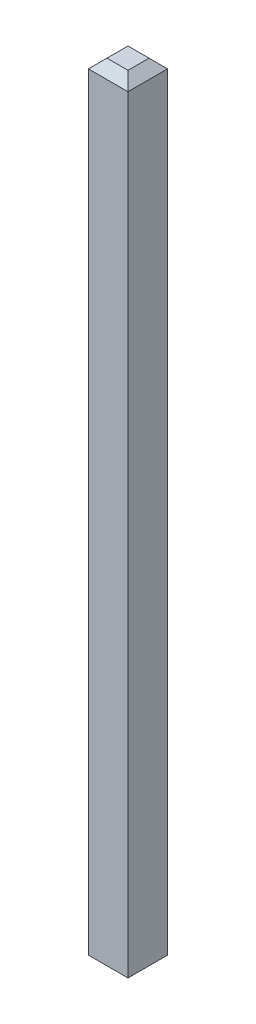
ISO-10303-21;
HEADER;
FILE_DESCRIPTION(('STEP AP214'),'2;1');
FILE_NAME('part.step','',(''),(''),'','','');
FILE_SCHEMA(('AUTOMOTIVE_DESIGN { 1 0 10303 214 1 1 1 1 }'));
ENDSEC;
DATA;
#1=APPLICATION_CONTEXT('core data for automotive mechanical design processes');
#2=APPLICATION_PROTOCOL_DEFINITION('international standard','automotive_design',2000,#1);
#3=PRODUCT_CONTEXT('',#1,'mechanical');
#4=PRODUCT('Part','Part','',(#3));
#5=PRODUCT_RELATED_PRODUCT_CATEGORY('part','',(#4));
#6=PRODUCT_DEFINITION_FORMATION('','',#4);
#7=PRODUCT_DEFINITION_CONTEXT('part definition',#1,'design');
#8=PRODUCT_DEFINITION('design','',#6,#7);
#9=PRODUCT_DEFINITION_SHAPE('','',#8);
#10=(LENGTH_UNIT() NAMED_UNIT(*) SI_UNIT(.MILLI.,.METRE.));
#11=(NAMED_UNIT(*) PLANE_ANGLE_UNIT() SI_UNIT($,.RADIAN.));
#12=(NAMED_UNIT(*) SI_UNIT($,.STERADIAN.) SOLID_ANGLE_UNIT());
#13=UNCERTAINTY_MEASURE_WITH_UNIT(LENGTH_MEASURE(1.E-05),#10,'distance_accuracy_value','');
#14=(GEOMETRIC_REPRESENTATION_CONTEXT(3) GLOBAL_UNCERTAINTY_ASSIGNED_CONTEXT((#13)) GLOBAL_UNIT_ASSIGNED_CONTEXT((#10,
#11,#12)) REPRESENTATION_CONTEXT('',''));
#15=CARTESIAN_POINT('',(0.,0.,0.));
#16=DIRECTION('',(0.,0.,1.));
#17=DIRECTION('',(1.,0.,0.));
#18=AXIS2_PLACEMENT_3D('',#15,#16,#17);
#19=CARTESIAN_POINT('',(-4.055,-1.925,-0.16));
#20=DIRECTION('',(-0.707106781186548,-0.707106781186548,0.));
#21=DIRECTION('',(0.707106781186548,-0.707106781186548,0.));
#22=AXIS2_PLACEMENT_3D('',#19,#20,#21);
#23=PLANE('',#22);
#24=DIRECTION('',(0.,0.,1.));
#25=VECTOR('',#24,1.);
#26=CARTESIAN_POINT('',(-4.13,-1.85,-0.32));
#27=LINE('',#26,#25);
#28=CARTESIAN_POINT('',(-4.13,-1.85,-0.32));
#29=VERTEX_POINT('',#28);
#30=CARTESIAN_POINT('',(-4.13,-1.85,0.32));
#31=VERTEX_POINT('',#30);
#32=EDGE_CURVE('E96',#29,#31,#27,.T.);
#33=ORIENTED_EDGE('',*,*,#32,.F.);
#34=DIRECTION('',(-0.577350269189626,0.577350269189626,-0.577350269189625));
#35=VECTOR('',#34,1.);
#36=CARTESIAN_POINT('',(-3.98,-2.,-0.17));
#37=LINE('',#36,#35);
#38=CARTESIAN_POINT('',(-3.98,-2.,-0.17));
#39=VERTEX_POINT('',#38);
#40=EDGE_CURVE('E94',#39,#29,#37,.T.);
#41=ORIENTED_EDGE('',*,*,#40,.F.);
#42=DIRECTION('',(0.,0.,1.));
#43=VECTOR('',#42,1.);
#44=CARTESIAN_POINT('',(-3.98,-2.,0.));
#45=LINE('',#44,#43);
#46=CARTESIAN_POINT('',(-3.98,-2.,0.17));
#47=VERTEX_POINT('',#46);
#48=EDGE_CURVE('E20',#39,#47,#45,.T.);
#49=ORIENTED_EDGE('',*,*,#48,.T.);
#50=DIRECTION('',(0.577350269189626,-0.577350269189626,-0.577350269189625));
#51=VECTOR('',#50,1.);
#52=CARTESIAN_POINT('',(-4.13,-1.85,0.32));
#53=LINE('',#52,#51);
#54=EDGE_CURVE('E112',#31,#47,#53,.T.);
#55=ORIENTED_EDGE('',*,*,#54,.F.);
#56=EDGE_LOOP('',(#33,#41,#49,#55));
#57=FACE_BOUND('',#56,.T.);
#58=ADVANCED_FACE('F17',(#57),#23,.T.);
#59=CARTESIAN_POINT('',(-4.055,10.625,-0.16));
#60=DIRECTION('',(-0.707106781186545,0.70710678118655,0.));
#61=DIRECTION('',(-0.70710678118655,-0.707106781186545,0.));
#62=AXIS2_PLACEMENT_3D('',#59,#60,#61);
#63=PLANE('',#62);
#64=DIRECTION('',(0.,0.,1.));
#65=VECTOR('',#64,1.);
#66=CARTESIAN_POINT('',(-4.13,10.55,-0.32));
#67=LINE('',#66,#65);
#68=CARTESIAN_POINT('',(-4.13,10.55,0.32));
#69=VERTEX_POINT('',#68);
#70=CARTESIAN_POINT('',(-4.13,10.55,-0.32));
#71=VERTEX_POINT('',#70);
#72=EDGE_CURVE('E121',#69,#71,#67,.F.);
#73=ORIENTED_EDGE('',*,*,#72,.F.);
#74=DIRECTION('',(-0.577350269189627,-0.577350269189623,0.577350269189627));
#75=VECTOR('',#74,1.);
#76=CARTESIAN_POINT('',(-3.98,10.7,0.170000000000001));
#77=LINE('',#76,#75);
#78=CARTESIAN_POINT('',(-3.98,10.7,0.17));
#79=VERTEX_POINT('',#78);
#80=EDGE_CURVE('E118',#79,#69,#77,.T.);
#81=ORIENTED_EDGE('',*,*,#80,.F.);
#82=DIRECTION('',(0.,0.,1.));
#83=VECTOR('',#82,1.);
#84=CARTESIAN_POINT('',(-3.98,10.7,0.));
#85=LINE('',#84,#83);
#86=CARTESIAN_POINT('',(-3.98,10.7,-0.17));
#87=VERTEX_POINT('',#86);
#88=EDGE_CURVE('E79',#87,#79,#85,.T.);
#89=ORIENTED_EDGE('',*,*,#88,.F.);
#90=DIRECTION('',(0.577350269189627,0.577350269189623,0.577350269189627));
#91=VECTOR('',#90,1.);
#92=CARTESIAN_POINT('',(-4.13,10.55,-0.320000000000001));
#93=LINE('',#92,#91);
#94=EDGE_CURVE('E106',#71,#87,#93,.T.);
#95=ORIENTED_EDGE('',*,*,#94,.F.);
#96=EDGE_LOOP('',(#73,#81,#89,#95));
#97=FACE_BOUND('',#96,.T.);
#98=ADVANCED_FACE('F283',(#97),#63,.T.);
#99=CARTESIAN_POINT('',(-3.81,-2.,0.));
#100=DIRECTION('',(0.,1.,0.));
#101=DIRECTION('',(0.,0.,1.));
#102=AXIS2_PLACEMENT_3D('',#99,#100,#101);
#103=PLANE('',#102);
#104=DIRECTION('',(0.,0.,1.));
#105=VECTOR('',#104,1.);
#106=CARTESIAN_POINT('',(-3.64,-2.,0.16));
#107=LINE('',#106,#105);
#108=CARTESIAN_POINT('',(-3.64,-2.,0.17));
#109=VERTEX_POINT('',#108);
#110=CARTESIAN_POINT('',(-3.64,-2.,-0.17));
#111=VERTEX_POINT('',#110);
#112=EDGE_CURVE('E124',#109,#111,#107,.F.);
#113=ORIENTED_EDGE('',*,*,#112,.F.);
#114=DIRECTION('',(1.,0.,0.));
#115=VECTOR('',#114,1.);
#116=CARTESIAN_POINT('',(-3.97,-2.,0.17));
#117=LINE('',#116,#115);
#118=EDGE_CURVE('E90',#47,#109,#117,.T.);
#119=ORIENTED_EDGE('',*,*,#118,.F.);
#120=ORIENTED_EDGE('',*,*,#48,.F.);
#121=DIRECTION('',(1.,0.,0.));
#122=VECTOR('',#121,1.);
#123=CARTESIAN_POINT('',(-3.65,-2.,-0.17));
#124=LINE('',#123,#122);
#125=EDGE_CURVE('E87',#111,#39,#124,.F.);
#126=ORIENTED_EDGE('',*,*,#125,.F.);
#127=EDGE_LOOP('',(#113,#119,#120,#126));
#128=FACE_BOUND('',#127,.T.);
#129=ADVANCED_FACE('F85',(#128),#103,.F.);
#130=CARTESIAN_POINT('',(-3.65,-1.925,-0.245));
#131=DIRECTION('',(0.,-0.707106781186547,-0.707106781186548));
#132=DIRECTION('',(0.,0.707106781186548,-0.707106781186547));
#133=AXIS2_PLACEMENT_3D('',#130,#131,#132);
#134=PLANE('',#133);
#135=DIRECTION('',(-1.,0.,0.));
#136=VECTOR('',#135,1.);
#137=CARTESIAN_POINT('',(-3.49,-1.85,-0.32));
#138=LINE('',#137,#136);
#139=CARTESIAN_POINT('',(-3.49,-1.85,-0.32));
#140=VERTEX_POINT('',#139);
#141=EDGE_CURVE('E130',#140,#29,#138,.T.);
#142=ORIENTED_EDGE('',*,*,#141,.F.);
#143=DIRECTION('',(0.577350269189625,0.577350269189625,-0.577350269189627));
#144=VECTOR('',#143,1.);
#145=CARTESIAN_POINT('',(-3.64,-2.,-0.17));
#146=LINE('',#145,#144);
#147=EDGE_CURVE('E102',#111,#140,#146,.T.);
#148=ORIENTED_EDGE('',*,*,#147,.F.);
#149=ORIENTED_EDGE('',*,*,#125,.T.);
#150=ORIENTED_EDGE('',*,*,#40,.T.);
#151=EDGE_LOOP('',(#142,#148,#149,#150));
#152=FACE_BOUND('',#151,.T.);
#153=ADVANCED_FACE('F100',(#152),#134,.T.);
#154=CARTESIAN_POINT('',(-3.81,10.7,0.));
#155=DIRECTION('',(0.,1.,0.));
#156=DIRECTION('',(0.,0.,1.));
#157=AXIS2_PLACEMENT_3D('',#154,#155,#156);
#158=PLANE('',#157);
#159=ORIENTED_EDGE('',*,*,#88,.T.);
#160=DIRECTION('',(1.,0.,0.));
#161=VECTOR('',#160,1.);
#162=CARTESIAN_POINT('',(-3.97,10.7,0.170000000000001));
#163=LINE('',#162,#161);
#164=CARTESIAN_POINT('',(-3.64,10.7,0.17));
#165=VERTEX_POINT('',#164);
#166=EDGE_CURVE('E115',#165,#79,#163,.F.);
#167=ORIENTED_EDGE('',*,*,#166,.F.);
#168=DIRECTION('',(0.,0.,1.));
#169=VECTOR('',#168,1.);
#170=CARTESIAN_POINT('',(-3.64,10.7,0.16));
#171=LINE('',#170,#169);
#172=CARTESIAN_POINT('',(-3.64,10.7,-0.17));
#173=VERTEX_POINT('',#172);
#174=EDGE_CURVE('E139',#173,#165,#171,.T.);
#175=ORIENTED_EDGE('',*,*,#174,.F.);
#176=DIRECTION('',(1.,0.,0.));
#177=VECTOR('',#176,1.);
#178=CARTESIAN_POINT('',(-3.65,10.7,-0.170000000000001));
#179=LINE('',#178,#177);
#180=EDGE_CURVE('E109',#87,#173,#179,.T.);
#181=ORIENTED_EDGE('',*,*,#180,.F.);
#182=EDGE_LOOP('',(#159,#167,#175,#181));
#183=FACE_BOUND('',#182,.T.);
#184=ADVANCED_FACE('F259',(#183),#158,.T.);
#185=CARTESIAN_POINT('',(-3.65,10.625,-0.245));
#186=DIRECTION('',(0.,0.70710678118655,-0.707106781186545));
#187=DIRECTION('',(0.,0.707106781186545,0.70710678118655));
#188=AXIS2_PLACEMENT_3D('',#185,#186,#187);
#189=PLANE('',#188);
#190=ORIENTED_EDGE('',*,*,#180,.T.);
#191=DIRECTION('',(-0.577350269189628,0.577350269189623,0.577350269189627));
#192=VECTOR('',#191,1.);
#193=CARTESIAN_POINT('',(-3.49,10.55,-0.32));
#194=LINE('',#193,#192);
#195=CARTESIAN_POINT('',(-3.49,10.55,-0.32));
#196=VERTEX_POINT('',#195);
#197=EDGE_CURVE('E144',#196,#173,#194,.T.);
#198=ORIENTED_EDGE('',*,*,#197,.F.);
#199=DIRECTION('',(-1.,0.,0.));
#200=VECTOR('',#199,1.);
#201=CARTESIAN_POINT('',(-3.49,10.55,-0.32));
#202=LINE('',#201,#200);
#203=EDGE_CURVE('E136',#71,#196,#202,.F.);
#204=ORIENTED_EDGE('',*,*,#203,.F.);
#205=ORIENTED_EDGE('',*,*,#94,.T.);
#206=EDGE_LOOP('',(#190,#198,#204,#205));
#207=FACE_BOUND('',#206,.T.);
#208=ADVANCED_FACE('F251',(#207),#189,.T.);
#209=CARTESIAN_POINT('',(-3.97,-1.925,0.245));
#210=DIRECTION('',(0.,-0.707106781186547,0.707106781186548));
#211=DIRECTION('',(0.,-0.707106781186548,-0.707106781186547));
#212=AXIS2_PLACEMENT_3D('',#209,#210,#211);
#213=PLANE('',#212);
#214=ORIENTED_EDGE('',*,*,#118,.T.);
#215=DIRECTION('',(-0.577350269189625,-0.577350269189626,-0.577350269189627));
#216=VECTOR('',#215,1.);
#217=CARTESIAN_POINT('',(-3.49,-1.85,0.32));
#218=LINE('',#217,#216);
#219=CARTESIAN_POINT('',(-3.49,-1.85,0.32));
#220=VERTEX_POINT('',#219);
#221=EDGE_CURVE('E127',#220,#109,#218,.T.);
#222=ORIENTED_EDGE('',*,*,#221,.F.);
#223=DIRECTION('',(1.,0.,0.));
#224=VECTOR('',#223,1.);
#225=CARTESIAN_POINT('',(-4.13,-1.85,0.32));
#226=LINE('',#225,#224);
#227=EDGE_CURVE('E147',#31,#220,#226,.T.);
#228=ORIENTED_EDGE('',*,*,#227,.F.);
#229=ORIENTED_EDGE('',*,*,#54,.T.);
#230=EDGE_LOOP('',(#214,#222,#228,#229));
#231=FACE_BOUND('',#230,.T.);
#232=ADVANCED_FACE('F173',(#231),#213,.T.);
#233=CARTESIAN_POINT('',(-3.97,10.625,0.245));
#234=DIRECTION('',(0.,0.70710678118655,0.707106781186545));
#235=DIRECTION('',(0.,-0.707106781186545,0.70710678118655));
#236=AXIS2_PLACEMENT_3D('',#233,#234,#235);
#237=PLANE('',#236);
#238=DIRECTION('',(1.,0.,0.));
#239=VECTOR('',#238,1.);
#240=CARTESIAN_POINT('',(-4.13,10.55,0.32));
#241=LINE('',#240,#239);
#242=CARTESIAN_POINT('',(-3.49,10.55,0.32));
#243=VERTEX_POINT('',#242);
#244=EDGE_CURVE('E35',#243,#69,#241,.F.);
#245=ORIENTED_EDGE('',*,*,#244,.F.);
#246=DIRECTION('',(0.577350269189628,-0.577350269189623,0.577350269189627));
#247=VECTOR('',#246,1.);
#248=CARTESIAN_POINT('',(-3.64,10.7,0.17));
#249=LINE('',#248,#247);
#250=EDGE_CURVE('E142',#165,#243,#249,.T.);
#251=ORIENTED_EDGE('',*,*,#250,.F.);
#252=ORIENTED_EDGE('',*,*,#166,.T.);
#253=ORIENTED_EDGE('',*,*,#80,.T.);
#254=EDGE_LOOP('',(#245,#251,#252,#253));
#255=FACE_BOUND('',#254,.T.);
#256=ADVANCED_FACE('F190',(#255),#237,.T.);
#257=CARTESIAN_POINT('',(-4.13,-2.,-0.32));
#258=DIRECTION('',(-1.,0.,0.));
#259=DIRECTION('',(0.,0.,1.));
#260=AXIS2_PLACEMENT_3D('',#257,#258,#259);
#261=PLANE('',#260);
#262=ORIENTED_EDGE('',*,*,#72,.T.);
#263=DIRECTION('',(0.,1.,0.));
#264=VECTOR('',#263,1.);
#265=CARTESIAN_POINT('',(-4.13,-2.,-0.32));
#266=LINE('',#265,#264);
#267=EDGE_CURVE('E133',#29,#71,#266,.T.);
#268=ORIENTED_EDGE('',*,*,#267,.F.);
#269=ORIENTED_EDGE('',*,*,#32,.T.);
#270=DIRECTION('',(0.,1.,0.));
#271=VECTOR('',#270,1.);
#272=CARTESIAN_POINT('',(-4.13,-2.,0.32));
#273=LINE('',#272,#271);
#274=EDGE_CURVE('E151',#69,#31,#273,.F.);
#275=ORIENTED_EDGE('',*,*,#274,.F.);
#276=EDGE_LOOP('',(#262,#268,#269,#275));
#277=FACE_BOUND('',#276,.T.);
#278=ADVANCED_FACE('F176',(#277),#261,.T.);
#279=CARTESIAN_POINT('',(-3.565,-1.925,0.16));
#280=DIRECTION('',(0.707106781186548,-0.707106781186548,0.));
#281=DIRECTION('',(0.707106781186548,0.707106781186548,0.));
#282=AXIS2_PLACEMENT_3D('',#279,#280,#281);
#283=PLANE('',#282);
#284=DIRECTION('',(0.,0.,-1.));
#285=VECTOR('',#284,1.);
#286=CARTESIAN_POINT('',(-3.49,-1.85,0.32));
#287=LINE('',#286,#285);
#288=EDGE_CURVE('E154',#220,#140,#287,.T.);
#289=ORIENTED_EDGE('',*,*,#288,.F.);
#290=ORIENTED_EDGE('',*,*,#221,.T.);
#291=ORIENTED_EDGE('',*,*,#112,.T.);
#292=ORIENTED_EDGE('',*,*,#147,.T.);
#293=EDGE_LOOP('',(#289,#290,#291,#292));
#294=FACE_BOUND('',#293,.T.);
#295=ADVANCED_FACE('F181',(#294),#283,.T.);
#296=CARTESIAN_POINT('',(-3.49,-2.,-0.32));
#297=DIRECTION('',(0.,0.,-1.));
#298=DIRECTION('',(-1.,0.,0.));
#299=AXIS2_PLACEMENT_3D('',#296,#297,#298);
#300=PLANE('',#299);
#301=ORIENTED_EDGE('',*,*,#203,.T.);
#302=DIRECTION('',(0.,1.,0.));
#303=VECTOR('',#302,1.);
#304=CARTESIAN_POINT('',(-3.49,-2.,-0.32));
#305=LINE('',#304,#303);
#306=EDGE_CURVE('E157',#140,#196,#305,.T.);
#307=ORIENTED_EDGE('',*,*,#306,.F.);
#308=ORIENTED_EDGE('',*,*,#141,.T.);
#309=ORIENTED_EDGE('',*,*,#267,.T.);
#310=EDGE_LOOP('',(#301,#307,#308,#309));
#311=FACE_BOUND('',#310,.T.);
#312=ADVANCED_FACE('F179',(#311),#300,.T.);
#313=CARTESIAN_POINT('',(-3.565,10.625,0.16));
#314=DIRECTION('',(0.707106781186545,0.70710678118655,0.));
#315=DIRECTION('',(-0.70710678118655,0.707106781186545,0.));
#316=AXIS2_PLACEMENT_3D('',#313,#314,#315);
#317=PLANE('',#316);
#318=DIRECTION('',(0.,0.,-1.));
#319=VECTOR('',#318,1.);
#320=CARTESIAN_POINT('',(-3.49,10.55,0.32));
#321=LINE('',#320,#319);
#322=EDGE_CURVE('E26',#196,#243,#321,.F.);
#323=ORIENTED_EDGE('',*,*,#322,.F.);
#324=ORIENTED_EDGE('',*,*,#197,.T.);
#325=ORIENTED_EDGE('',*,*,#174,.T.);
#326=ORIENTED_EDGE('',*,*,#250,.T.);
#327=EDGE_LOOP('',(#323,#324,#325,#326));
#328=FACE_BOUND('',#327,.T.);
#329=ADVANCED_FACE('F167',(#328),#317,.T.);
#330=CARTESIAN_POINT('',(-4.13,-2.,0.32));
#331=DIRECTION('',(0.,0.,1.));
#332=DIRECTION('',(1.,0.,0.));
#333=AXIS2_PLACEMENT_3D('',#330,#331,#332);
#334=PLANE('',#333);
#335=ORIENTED_EDGE('',*,*,#244,.T.);
#336=ORIENTED_EDGE('',*,*,#274,.T.);
#337=ORIENTED_EDGE('',*,*,#227,.T.);
#338=DIRECTION('',(0.,1.,0.));
#339=VECTOR('',#338,1.);
#340=CARTESIAN_POINT('',(-3.49,-2.,0.32));
#341=LINE('',#340,#339);
#342=EDGE_CURVE('E11',#243,#220,#341,.F.);
#343=ORIENTED_EDGE('',*,*,#342,.F.);
#344=EDGE_LOOP('',(#335,#336,#337,#343));
#345=FACE_BOUND('',#344,.T.);
#346=ADVANCED_FACE('F169',(#345),#334,.T.);
#347=CARTESIAN_POINT('',(-3.49,-2.,0.32));
#348=DIRECTION('',(1.,0.,0.));
#349=DIRECTION('',(0.,0.,-1.));
#350=AXIS2_PLACEMENT_3D('',#347,#348,#349);
#351=PLANE('',#350);
#352=ORIENTED_EDGE('',*,*,#322,.T.);
#353=ORIENTED_EDGE('',*,*,#342,.T.);
#354=ORIENTED_EDGE('',*,*,#288,.T.);
#355=ORIENTED_EDGE('',*,*,#306,.T.);
#356=EDGE_LOOP('',(#352,#353,#354,#355));
#357=FACE_BOUND('',#356,.T.);
#358=ADVANCED_FACE('F163',(#357),#351,.T.);
#359=CLOSED_SHELL('',(#58,#98,#129,#153,#184,#208,#232,#256,#278,#295,#312,#329,#346,#358));
#360=MANIFOLD_SOLID_BREP('B1',#359);
#361=ADVANCED_BREP_SHAPE_REPRESENTATION('',(#18,#360),#14);
#362=SHAPE_DEFINITION_REPRESENTATION(#9,#361);
ENDSEC;
END-ISO-10303-21;
